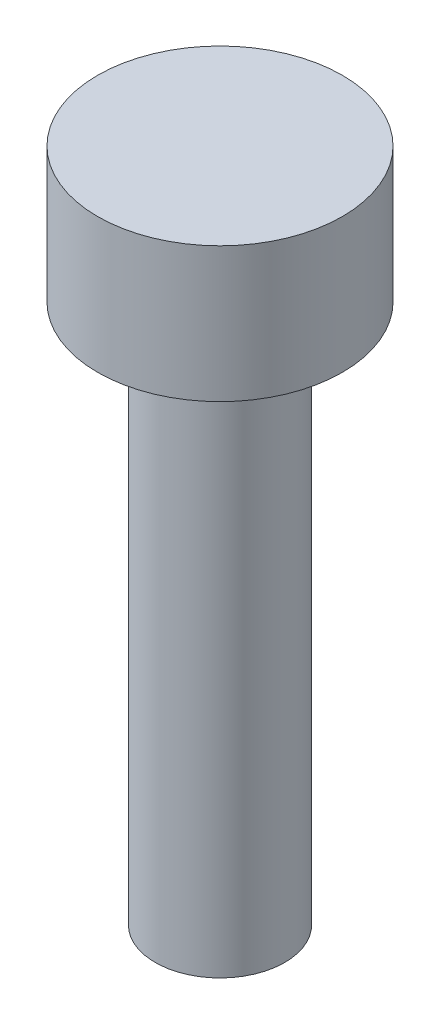
ISO-10303-21;
HEADER;
FILE_DESCRIPTION(('STEP AP214'),'2;1');
FILE_NAME('part.step','',(''),(''),'','','');
FILE_SCHEMA(('AUTOMOTIVE_DESIGN { 1 0 10303 214 1 1 1 1 }'));
ENDSEC;
DATA;
#1=APPLICATION_CONTEXT('core data for automotive mechanical design processes');
#2=APPLICATION_PROTOCOL_DEFINITION('international standard','automotive_design',2000,#1);
#3=PRODUCT_CONTEXT('',#1,'mechanical');
#4=PRODUCT('Part','Part','',(#3));
#5=PRODUCT_RELATED_PRODUCT_CATEGORY('part','',(#4));
#6=PRODUCT_DEFINITION_FORMATION('','',#4);
#7=PRODUCT_DEFINITION_CONTEXT('part definition',#1,'design');
#8=PRODUCT_DEFINITION('design','',#6,#7);
#9=PRODUCT_DEFINITION_SHAPE('','',#8);
#10=(LENGTH_UNIT() NAMED_UNIT(*) SI_UNIT(.MILLI.,.METRE.));
#11=(NAMED_UNIT(*) PLANE_ANGLE_UNIT() SI_UNIT($,.RADIAN.));
#12=(NAMED_UNIT(*) SI_UNIT($,.STERADIAN.) SOLID_ANGLE_UNIT());
#13=UNCERTAINTY_MEASURE_WITH_UNIT(LENGTH_MEASURE(1.E-05),#10,'distance_accuracy_value','');
#14=(GEOMETRIC_REPRESENTATION_CONTEXT(3) GLOBAL_UNCERTAINTY_ASSIGNED_CONTEXT((#13)) GLOBAL_UNIT_ASSIGNED_CONTEXT((#10,
#11,#12)) REPRESENTATION_CONTEXT('',''));
#15=CARTESIAN_POINT('',(0.,0.,0.));
#16=DIRECTION('',(0.,0.,1.));
#17=DIRECTION('',(1.,0.,0.));
#18=AXIS2_PLACEMENT_3D('',#15,#16,#17);
#19=CARTESIAN_POINT('',(0.,3.,0.));
#20=DIRECTION('',(0.,-1.,0.));
#21=DIRECTION('',(0.,0.,-1.));
#22=AXIS2_PLACEMENT_3D('',#19,#20,#21);
#23=CYLINDRICAL_SURFACE('',#22,2.72);
#24=CARTESIAN_POINT('',(0.,3.,0.));
#25=DIRECTION('',(0.,1.,0.));
#26=DIRECTION('',(0.,0.,1.));
#27=AXIS2_PLACEMENT_3D('',#24,#25,#26);
#28=CIRCLE('',#27,2.72);
#29=CARTESIAN_POINT('',(0.,3.,2.72));
#30=VERTEX_POINT('',#29);
#31=EDGE_CURVE('E44',#30,#30,#28,.T.);
#32=ORIENTED_EDGE('',*,*,#31,.F.);
#33=EDGE_LOOP('',(#32));
#34=FACE_BOUND('',#33,.T.);
#35=CARTESIAN_POINT('',(0.,0.,0.));
#36=DIRECTION('',(0.,1.,0.));
#37=DIRECTION('',(0.,0.,1.));
#38=AXIS2_PLACEMENT_3D('',#35,#36,#37);
#39=CIRCLE('',#38,2.72);
#40=CARTESIAN_POINT('',(0.,0.,2.72));
#41=VERTEX_POINT('',#40);
#42=EDGE_CURVE('E40',#41,#41,#39,.T.);
#43=ORIENTED_EDGE('',*,*,#42,.T.);
#44=EDGE_LOOP('',(#43));
#45=FACE_BOUND('',#44,.T.);
#46=ADVANCED_FACE('F37',(#34,#45),#23,.T.);
#47=CARTESIAN_POINT('',(0.,3.,0.));
#48=DIRECTION('',(0.,1.,0.));
#49=DIRECTION('',(0.,0.,1.));
#50=AXIS2_PLACEMENT_3D('',#47,#48,#49);
#51=PLANE('',#50);
#52=ORIENTED_EDGE('',*,*,#31,.T.);
#53=EDGE_LOOP('',(#52));
#54=FACE_BOUND('',#53,.T.);
#55=ADVANCED_FACE('F61',(#54),#51,.T.);
#56=CARTESIAN_POINT('',(0.,0.,0.));
#57=DIRECTION('',(0.,1.,0.));
#58=DIRECTION('',(0.,0.,1.));
#59=AXIS2_PLACEMENT_3D('',#56,#57,#58);
#60=PLANE('',#59);
#61=CARTESIAN_POINT('',(0.,0.,0.));
#62=DIRECTION('',(0.,-1.,0.));
#63=DIRECTION('',(0.,0.,-1.));
#64=AXIS2_PLACEMENT_3D('',#61,#62,#63);
#65=CIRCLE('',#64,1.44);
#66=CARTESIAN_POINT('',(0.,0.,-1.44));
#67=VERTEX_POINT('',#66);
#68=EDGE_CURVE('E10',#67,#67,#65,.T.);
#69=ORIENTED_EDGE('',*,*,#68,.F.);
#70=EDGE_LOOP('',(#69));
#71=FACE_BOUND('',#70,.T.);
#72=ORIENTED_EDGE('',*,*,#42,.F.);
#73=EDGE_LOOP('',(#72));
#74=FACE_BOUND('',#73,.T.);
#75=ADVANCED_FACE('F58',(#71,#74),#60,.F.);
#76=CARTESIAN_POINT('',(0.,-12.,0.));
#77=DIRECTION('',(0.,1.,0.));
#78=DIRECTION('',(0.,0.,1.));
#79=AXIS2_PLACEMENT_3D('',#76,#77,#78);
#80=CYLINDRICAL_SURFACE('',#79,1.44);
#81=CARTESIAN_POINT('',(0.,-12.,0.));
#82=DIRECTION('',(0.,-1.,0.));
#83=DIRECTION('',(0.,0.,-1.));
#84=AXIS2_PLACEMENT_3D('',#81,#82,#83);
#85=CIRCLE('',#84,1.44);
#86=CARTESIAN_POINT('',(0.,-12.,-1.44));
#87=VERTEX_POINT('',#86);
#88=EDGE_CURVE('E50',#87,#87,#85,.T.);
#89=ORIENTED_EDGE('',*,*,#88,.F.);
#90=EDGE_LOOP('',(#89));
#91=FACE_BOUND('',#90,.T.);
#92=ORIENTED_EDGE('',*,*,#68,.T.);
#93=EDGE_LOOP('',(#92));
#94=FACE_BOUND('',#93,.T.);
#95=ADVANCED_FACE('F60',(#91,#94),#80,.T.);
#96=CARTESIAN_POINT('',(0.,-12.,0.));
#97=DIRECTION('',(0.,-1.,0.));
#98=DIRECTION('',(0.,0.,-1.));
#99=AXIS2_PLACEMENT_3D('',#96,#97,#98);
#100=PLANE('',#99);
#101=ORIENTED_EDGE('',*,*,#88,.T.);
#102=EDGE_LOOP('',(#101));
#103=FACE_BOUND('',#102,.T.);
#104=ADVANCED_FACE('F67',(#103),#100,.T.);
#105=CLOSED_SHELL('',(#46,#55,#75,#95,#104));
#106=MANIFOLD_SOLID_BREP('B2',#105);
#107=ADVANCED_BREP_SHAPE_REPRESENTATION('',(#18,#106),#14);
#108=SHAPE_DEFINITION_REPRESENTATION(#9,#107);
ENDSEC;
END-ISO-10303-21;
